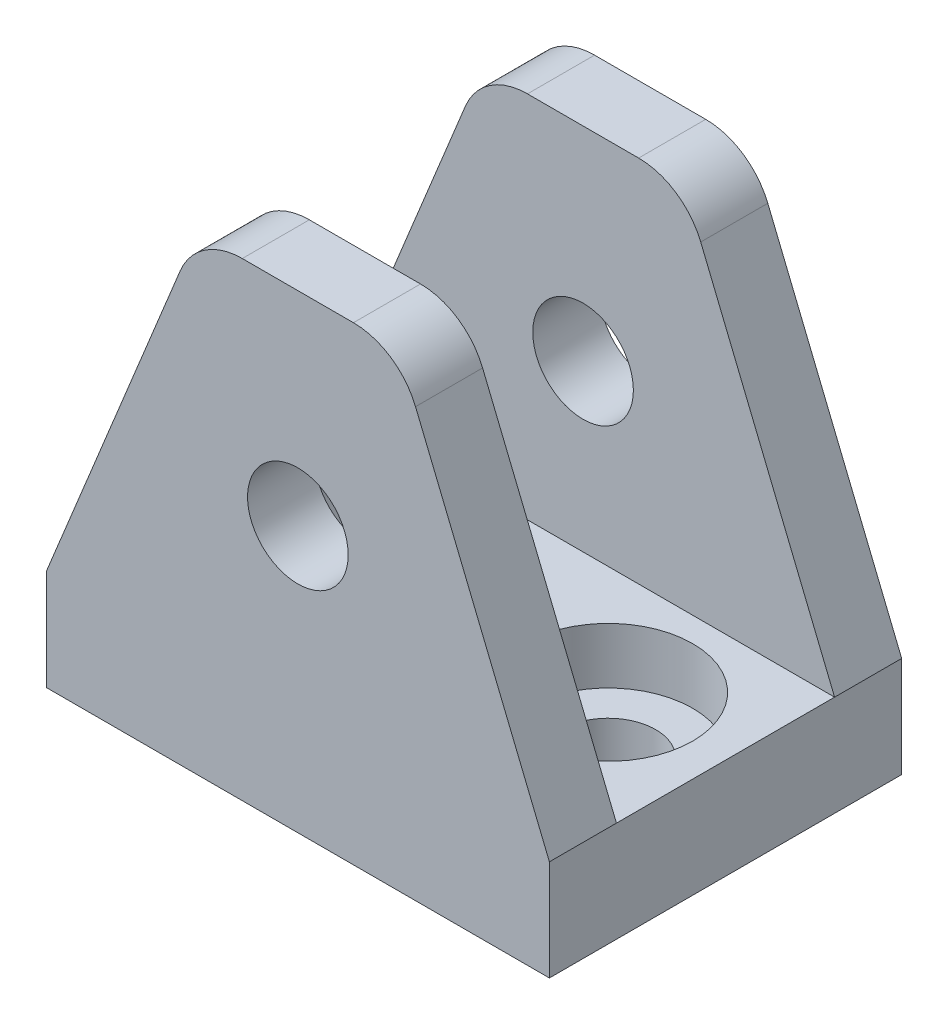
ISO-10303-21;
HEADER;
FILE_DESCRIPTION(('STEP AP214'),'2;1');
FILE_NAME('part.step','',(''),(''),'','','');
FILE_SCHEMA(('AUTOMOTIVE_DESIGN { 1 0 10303 214 1 1 1 1 }'));
ENDSEC;
DATA;
#1=APPLICATION_CONTEXT('core data for automotive mechanical design processes');
#2=APPLICATION_PROTOCOL_DEFINITION('international standard','automotive_design',2000,#1);
#3=PRODUCT_CONTEXT('',#1,'mechanical');
#4=PRODUCT('Part','Part','',(#3));
#5=PRODUCT_RELATED_PRODUCT_CATEGORY('part','',(#4));
#6=PRODUCT_DEFINITION_FORMATION('','',#4);
#7=PRODUCT_DEFINITION_CONTEXT('part definition',#1,'design');
#8=PRODUCT_DEFINITION('design','',#6,#7);
#9=PRODUCT_DEFINITION_SHAPE('','',#8);
#10=(LENGTH_UNIT() NAMED_UNIT(*) SI_UNIT(.MILLI.,.METRE.));
#11=(NAMED_UNIT(*) PLANE_ANGLE_UNIT() SI_UNIT($,.RADIAN.));
#12=(NAMED_UNIT(*) SI_UNIT($,.STERADIAN.) SOLID_ANGLE_UNIT());
#13=UNCERTAINTY_MEASURE_WITH_UNIT(LENGTH_MEASURE(1.E-05),#10,'distance_accuracy_value','');
#14=(GEOMETRIC_REPRESENTATION_CONTEXT(3) GLOBAL_UNCERTAINTY_ASSIGNED_CONTEXT((#13)) GLOBAL_UNIT_ASSIGNED_CONTEXT((#10,
#11,#12)) REPRESENTATION_CONTEXT('',''));
#15=CARTESIAN_POINT('',(0.,0.,0.));
#16=DIRECTION('',(0.,0.,1.));
#17=DIRECTION('',(1.,0.,0.));
#18=AXIS2_PLACEMENT_3D('',#15,#16,#17);
#19=CARTESIAN_POINT('',(0.,44.45,0.));
#20=DIRECTION('',(0.,-1.,0.));
#21=DIRECTION('',(0.,0.,-1.));
#22=AXIS2_PLACEMENT_3D('',#19,#20,#21);
#23=PLANE('',#22);
#24=DIRECTION('',(-1.,0.,0.));
#25=VECTOR('',#24,1.);
#26=CARTESIAN_POINT('',(-23.8125,44.45,-10.3251));
#27=LINE('',#26,#25);
#28=CARTESIAN_POINT('',(5.26191923114274,44.45,-10.3251));
#29=VERTEX_POINT('',#28);
#30=CARTESIAN_POINT('',(-5.26191923114273,44.45,-10.3251));
#31=VERTEX_POINT('',#30);
#32=EDGE_CURVE('E229',#29,#31,#27,.T.);
#33=ORIENTED_EDGE('',*,*,#32,.F.);
#34=DIRECTION('',(0.,0.,-1.));
#35=VECTOR('',#34,1.);
#36=CARTESIAN_POINT('',(5.26191923114274,44.45,0.));
#37=LINE('',#36,#35);
#38=CARTESIAN_POINT('',(5.26191923114274,44.45,-16.6751));
#39=VERTEX_POINT('',#38);
#40=EDGE_CURVE('E222',#29,#39,#37,.T.);
#41=ORIENTED_EDGE('',*,*,#40,.T.);
#42=DIRECTION('',(-1.,0.,0.));
#43=VECTOR('',#42,1.);
#44=CARTESIAN_POINT('',(-23.8125,44.45,-16.6751));
#45=LINE('',#44,#43);
#46=CARTESIAN_POINT('',(-5.26191923114273,44.45,-16.6751));
#47=VERTEX_POINT('',#46);
#48=EDGE_CURVE('E255',#39,#47,#45,.T.);
#49=ORIENTED_EDGE('',*,*,#48,.T.);
#50=DIRECTION('',(0.,0.,-1.));
#51=VECTOR('',#50,1.);
#52=CARTESIAN_POINT('',(-5.26191923114273,44.45,-10.3251));
#53=LINE('',#52,#51);
#54=EDGE_CURVE('E220',#47,#31,#53,.F.);
#55=ORIENTED_EDGE('',*,*,#54,.T.);
#56=EDGE_LOOP('',(#33,#41,#49,#55));
#57=FACE_BOUND('',#56,.T.);
#58=ADVANCED_FACE('F41',(#57),#23,.F.);
#59=CARTESIAN_POINT('',(-23.8125,44.45,-16.6751));
#60=DIRECTION('',(0.,0.,1.));
#61=DIRECTION('',(1.,0.,0.));
#62=AXIS2_PLACEMENT_3D('',#59,#60,#61);
#63=PLANE('',#62);
#64=CARTESIAN_POINT('',(-2.32470293015652E-11,25.1616625766068,-16.6751));
#65=DIRECTION('',(0.,0.,1.));
#66=DIRECTION('',(1.,0.,0.));
#67=AXIS2_PLACEMENT_3D('',#64,#65,#66);
#68=CIRCLE('',#67,4.76249999999999);
#69=CARTESIAN_POINT('',(4.76249999997674,25.1616625766068,-16.6751));
#70=VERTEX_POINT('',#69);
#71=EDGE_CURVE('E45',#70,#70,#68,.T.);
#72=ORIENTED_EDGE('',*,*,#71,.T.);
#73=EDGE_LOOP('',(#72));
#74=FACE_BOUND('',#73,.T.);
#75=ORIENTED_EDGE('',*,*,#48,.F.);
#76=CARTESIAN_POINT('',(5.26191923114274,38.1,-16.6751));
#77=DIRECTION('',(0.,0.,1.));
#78=DIRECTION('',(1.,0.,0.));
#79=AXIS2_PLACEMENT_3D('',#76,#77,#78);
#80=CIRCLE('',#79,6.35);
#81=CARTESIAN_POINT('',(11.1391424030488,40.5043185703252,-16.6751));
#82=VERTEX_POINT('',#81);
#83=EDGE_CURVE('E347',#39,#82,#80,.F.);
#84=ORIENTED_EDGE('',*,*,#83,.T.);
#85=DIRECTION('',(0.378632845720504,-0.925546956205677,0.));
#86=VECTOR('',#85,1.);
#87=CARTESIAN_POINT('',(4.74564159292036,56.1328761061947,-16.6751));
#88=LINE('',#87,#86);
#89=CARTESIAN_POINT('',(23.8125,9.525,-16.6751));
#90=VERTEX_POINT('',#89);
#91=EDGE_CURVE('E231',#82,#90,#88,.T.);
#92=ORIENTED_EDGE('',*,*,#91,.T.);
#93=DIRECTION('',(0.,-1.,0.));
#94=VECTOR('',#93,1.);
#95=CARTESIAN_POINT('',(23.8125,44.45,-16.6751));
#96=LINE('',#95,#94);
#97=CARTESIAN_POINT('',(23.8125,0.,-16.6751));
#98=VERTEX_POINT('',#97);
#99=EDGE_CURVE('E180',#90,#98,#96,.T.);
#100=ORIENTED_EDGE('',*,*,#99,.T.);
#101=DIRECTION('',(-1.,0.,0.));
#102=VECTOR('',#101,1.);
#103=CARTESIAN_POINT('',(-23.8125,0.,-16.6751));
#104=LINE('',#103,#102);
#105=CARTESIAN_POINT('',(-23.8125,0.,-16.6751));
#106=VERTEX_POINT('',#105);
#107=EDGE_CURVE('E263',#98,#106,#104,.T.);
#108=ORIENTED_EDGE('',*,*,#107,.T.);
#109=DIRECTION('',(0.,-1.,0.));
#110=VECTOR('',#109,1.);
#111=CARTESIAN_POINT('',(-23.8125,44.45,-16.6751));
#112=LINE('',#111,#110);
#113=CARTESIAN_POINT('',(-23.8125,9.525,-16.6751));
#114=VERTEX_POINT('',#113);
#115=EDGE_CURVE('E177',#114,#106,#112,.T.);
#116=ORIENTED_EDGE('',*,*,#115,.F.);
#117=DIRECTION('',(-0.378632845720504,-0.925546956205677,0.));
#118=VECTOR('',#117,1.);
#119=CARTESIAN_POINT('',(-11.573296460177,39.4430530973451,-16.6751));
#120=LINE('',#119,#118);
#121=CARTESIAN_POINT('',(-11.1391424030488,40.5043185703252,-16.6751));
#122=VERTEX_POINT('',#121);
#123=EDGE_CURVE('E226',#122,#114,#120,.T.);
#124=ORIENTED_EDGE('',*,*,#123,.F.);
#125=CARTESIAN_POINT('',(-5.26191923114273,38.1,-16.6751));
#126=DIRECTION('',(0.,0.,1.));
#127=DIRECTION('',(1.,0.,0.));
#128=AXIS2_PLACEMENT_3D('',#125,#126,#127);
#129=CIRCLE('',#128,6.35);
#130=EDGE_CURVE('E225',#122,#47,#129,.F.);
#131=ORIENTED_EDGE('',*,*,#130,.T.);
#132=EDGE_LOOP('',(#75,#84,#92,#100,#108,#116,#124,#131));
#133=FACE_BOUND('',#132,.T.);
#134=ADVANCED_FACE('F322',(#74,#133),#63,.F.);
#135=CARTESIAN_POINT('',(-23.8125,44.45,16.6751));
#136=DIRECTION('',(1.,0.,0.));
#137=DIRECTION('',(0.,0.,-1.));
#138=AXIS2_PLACEMENT_3D('',#135,#136,#137);
#139=PLANE('',#138);
#140=DIRECTION('',(0.,0.,-1.));
#141=VECTOR('',#140,1.);
#142=CARTESIAN_POINT('',(-23.8125,9.525,16.6751));
#143=LINE('',#142,#141);
#144=CARTESIAN_POINT('',(-23.8125,9.525,-10.3251));
#145=VERTEX_POINT('',#144);
#146=EDGE_CURVE('E159',#145,#114,#143,.T.);
#147=ORIENTED_EDGE('',*,*,#146,.T.);
#148=ORIENTED_EDGE('',*,*,#115,.T.);
#149=DIRECTION('',(0.,0.,1.));
#150=VECTOR('',#149,1.);
#151=CARTESIAN_POINT('',(-23.8125,0.,16.6751));
#152=LINE('',#151,#150);
#153=CARTESIAN_POINT('',(-23.8125,0.,16.6751));
#154=VERTEX_POINT('',#153);
#155=EDGE_CURVE('E175',#106,#154,#152,.T.);
#156=ORIENTED_EDGE('',*,*,#155,.T.);
#157=DIRECTION('',(0.,-1.,0.));
#158=VECTOR('',#157,1.);
#159=CARTESIAN_POINT('',(-23.8125,44.45,16.6751));
#160=LINE('',#159,#158);
#161=CARTESIAN_POINT('',(-23.8125,9.525,16.6751));
#162=VERTEX_POINT('',#161);
#163=EDGE_CURVE('E165',#162,#154,#160,.T.);
#164=ORIENTED_EDGE('',*,*,#163,.F.);
#165=CARTESIAN_POINT('',(-23.8125,9.525,10.3251));
#166=VERTEX_POINT('',#165);
#167=EDGE_CURVE('E146',#162,#166,#143,.T.);
#168=ORIENTED_EDGE('',*,*,#167,.T.);
#169=DIRECTION('',(0.,0.,1.));
#170=VECTOR('',#169,1.);
#171=CARTESIAN_POINT('',(-23.8125,9.525,10.3251));
#172=LINE('',#171,#170);
#173=EDGE_CURVE('E245',#145,#166,#172,.T.);
#174=ORIENTED_EDGE('',*,*,#173,.F.);
#175=EDGE_LOOP('',(#147,#148,#156,#164,#168,#174));
#176=FACE_BOUND('',#175,.T.);
#177=ADVANCED_FACE('F173',(#176),#139,.F.);
#178=CARTESIAN_POINT('',(-23.8125,44.45,16.6751));
#179=DIRECTION('',(0.,0.,-1.));
#180=DIRECTION('',(-1.,0.,0.));
#181=AXIS2_PLACEMENT_3D('',#178,#179,#180);
#182=PLANE('',#181);
#183=CARTESIAN_POINT('',(-2.32470293015652E-11,25.1616625766068,16.6751));
#184=DIRECTION('',(0.,0.,1.));
#185=DIRECTION('',(1.,0.,0.));
#186=AXIS2_PLACEMENT_3D('',#183,#184,#185);
#187=CIRCLE('',#186,4.76249999999999);
#188=CARTESIAN_POINT('',(4.76249999997674,25.1616625766068,16.6751));
#189=VERTEX_POINT('',#188);
#190=EDGE_CURVE('E315',#189,#189,#187,.T.);
#191=ORIENTED_EDGE('',*,*,#190,.F.);
#192=EDGE_LOOP('',(#191));
#193=FACE_BOUND('',#192,.T.);
#194=DIRECTION('',(-0.378632845720504,0.925546956205677,0.));
#195=VECTOR('',#194,1.);
#196=CARTESIAN_POINT('',(23.7366371681416,9.71044247787611,16.6751));
#197=LINE('',#196,#195);
#198=CARTESIAN_POINT('',(23.8125,9.525,16.6751));
#199=VERTEX_POINT('',#198);
#200=CARTESIAN_POINT('',(11.1391424030488,40.5043185703252,16.6751));
#201=VERTEX_POINT('',#200);
#202=EDGE_CURVE('E197',#199,#201,#197,.T.);
#203=ORIENTED_EDGE('',*,*,#202,.T.);
#204=CARTESIAN_POINT('',(5.26191923114274,38.1,16.6751));
#205=DIRECTION('',(0.,0.,-1.));
#206=DIRECTION('',(-1.,0.,0.));
#207=AXIS2_PLACEMENT_3D('',#204,#205,#206);
#208=CIRCLE('',#207,6.35);
#209=CARTESIAN_POINT('',(5.26191923114274,44.45,16.6751));
#210=VERTEX_POINT('',#209);
#211=EDGE_CURVE('E216',#201,#210,#208,.F.);
#212=ORIENTED_EDGE('',*,*,#211,.T.);
#213=DIRECTION('',(1.,0.,0.));
#214=VECTOR('',#213,1.);
#215=CARTESIAN_POINT('',(-23.8125,44.45,16.6751));
#216=LINE('',#215,#214);
#217=CARTESIAN_POINT('',(-5.26191923114273,44.45,16.6751));
#218=VERTEX_POINT('',#217);
#219=EDGE_CURVE('E182',#218,#210,#216,.T.);
#220=ORIENTED_EDGE('',*,*,#219,.F.);
#221=CARTESIAN_POINT('',(-5.26191923114273,38.1,16.6751));
#222=DIRECTION('',(0.,0.,-1.));
#223=DIRECTION('',(-1.,0.,0.));
#224=AXIS2_PLACEMENT_3D('',#221,#222,#223);
#225=CIRCLE('',#224,6.35);
#226=CARTESIAN_POINT('',(-11.1391424030488,40.5043185703252,16.6751));
#227=VERTEX_POINT('',#226);
#228=EDGE_CURVE('E169',#218,#227,#225,.F.);
#229=ORIENTED_EDGE('',*,*,#228,.T.);
#230=DIRECTION('',(0.378632845720504,0.925546956205677,0.));
#231=VECTOR('',#230,1.);
#232=CARTESIAN_POINT('',(-23.7366371681416,9.71044247787611,16.6751));
#233=LINE('',#232,#231);
#234=EDGE_CURVE('E150',#162,#227,#233,.T.);
#235=ORIENTED_EDGE('',*,*,#234,.F.);
#236=ORIENTED_EDGE('',*,*,#163,.T.);
#237=DIRECTION('',(1.,0.,0.));
#238=VECTOR('',#237,1.);
#239=CARTESIAN_POINT('',(-23.8125,0.,16.6751));
#240=LINE('',#239,#238);
#241=CARTESIAN_POINT('',(23.8125,0.,16.6751));
#242=VERTEX_POINT('',#241);
#243=EDGE_CURVE('E258',#154,#242,#240,.T.);
#244=ORIENTED_EDGE('',*,*,#243,.T.);
#245=DIRECTION('',(0.,-1.,0.));
#246=VECTOR('',#245,1.);
#247=CARTESIAN_POINT('',(23.8125,44.45,16.6751));
#248=LINE('',#247,#246);
#249=EDGE_CURVE('E178',#199,#242,#248,.T.);
#250=ORIENTED_EDGE('',*,*,#249,.F.);
#251=EDGE_LOOP('',(#203,#212,#220,#229,#235,#236,#244,#250));
#252=FACE_BOUND('',#251,.T.);
#253=ADVANCED_FACE('F163',(#193,#252),#182,.F.);
#254=ORIENTED_EDGE('',*,*,#219,.T.);
#255=DIRECTION('',(0.,0.,-1.));
#256=VECTOR('',#255,1.);
#257=CARTESIAN_POINT('',(5.26191923114274,44.45,0.));
#258=LINE('',#257,#256);
#259=CARTESIAN_POINT('',(5.26191923114274,44.45,10.3251));
#260=VERTEX_POINT('',#259);
#261=EDGE_CURVE('E206',#210,#260,#258,.T.);
#262=ORIENTED_EDGE('',*,*,#261,.T.);
#263=DIRECTION('',(1.,0.,0.));
#264=VECTOR('',#263,1.);
#265=CARTESIAN_POINT('',(-23.8125,44.45,10.3251));
#266=LINE('',#265,#264);
#267=CARTESIAN_POINT('',(-5.26191923114273,44.45,10.3251));
#268=VERTEX_POINT('',#267);
#269=EDGE_CURVE('E238',#268,#260,#266,.T.);
#270=ORIENTED_EDGE('',*,*,#269,.F.);
#271=DIRECTION('',(0.,0.,-1.));
#272=VECTOR('',#271,1.);
#273=CARTESIAN_POINT('',(-5.26191923114273,44.45,16.6751));
#274=LINE('',#273,#272);
#275=EDGE_CURVE('E204',#268,#218,#274,.F.);
#276=ORIENTED_EDGE('',*,*,#275,.T.);
#277=EDGE_LOOP('',(#254,#262,#270,#276));
#278=FACE_BOUND('',#277,.T.);
#279=ADVANCED_FACE('F335',(#278),#23,.F.);
#280=CARTESIAN_POINT('',(-23.8125,-51.9092610719899,-10.3251));
#281=DIRECTION('',(0.,0.,-1.));
#282=DIRECTION('',(-1.,0.,0.));
#283=AXIS2_PLACEMENT_3D('',#280,#281,#282);
#284=PLANE('',#283);
#285=CARTESIAN_POINT('',(-2.32470293015652E-11,25.1616625766068,-10.3251));
#286=DIRECTION('',(0.,0.,-1.));
#287=DIRECTION('',(-1.,0.,0.));
#288=AXIS2_PLACEMENT_3D('',#285,#286,#287);
#289=CIRCLE('',#288,4.76249999999999);
#290=CARTESIAN_POINT('',(-4.76250000002324,25.1616625766068,-10.3251));
#291=VERTEX_POINT('',#290);
#292=EDGE_CURVE('E309',#291,#291,#289,.T.);
#293=ORIENTED_EDGE('',*,*,#292,.T.);
#294=EDGE_LOOP('',(#293));
#295=FACE_BOUND('',#294,.T.);
#296=DIRECTION('',(-0.378632845720504,0.925546956205677,0.));
#297=VECTOR('',#296,1.);
#298=CARTESIAN_POINT('',(38.5140198092991,-26.4120484227311,-10.3251));
#299=LINE('',#298,#297);
#300=CARTESIAN_POINT('',(23.8125,9.525,-10.3251));
#301=VERTEX_POINT('',#300);
#302=CARTESIAN_POINT('',(11.1391424030488,40.5043185703252,-10.3251));
#303=VERTEX_POINT('',#302);
#304=EDGE_CURVE('E158',#301,#303,#299,.T.);
#305=ORIENTED_EDGE('',*,*,#304,.T.);
#306=CARTESIAN_POINT('',(5.26191923114274,38.1,-10.3251));
#307=DIRECTION('',(0.,0.,-1.));
#308=DIRECTION('',(-1.,0.,0.));
#309=AXIS2_PLACEMENT_3D('',#306,#307,#308);
#310=CIRCLE('',#309,6.35);
#311=EDGE_CURVE('E50',#303,#29,#310,.F.);
#312=ORIENTED_EDGE('',*,*,#311,.T.);
#313=ORIENTED_EDGE('',*,*,#32,.T.);
#314=CARTESIAN_POINT('',(-5.26191923114273,38.1,-10.3251));
#315=DIRECTION('',(0.,0.,-1.));
#316=DIRECTION('',(-1.,0.,0.));
#317=AXIS2_PLACEMENT_3D('',#314,#315,#316);
#318=CIRCLE('',#317,6.35);
#319=CARTESIAN_POINT('',(-11.1391424030488,40.5043185703252,-10.3251));
#320=VERTEX_POINT('',#319);
#321=EDGE_CURVE('E57',#31,#320,#318,.F.);
#322=ORIENTED_EDGE('',*,*,#321,.T.);
#323=DIRECTION('',(0.378632845720504,0.925546956205677,0.));
#324=VECTOR('',#323,1.);
#325=CARTESIAN_POINT('',(-45.3416746765557,-43.1018714315807,-10.3251));
#326=LINE('',#325,#324);
#327=EDGE_CURVE('E230',#145,#320,#326,.T.);
#328=ORIENTED_EDGE('',*,*,#327,.F.);
#329=DIRECTION('',(-1.,0.,0.));
#330=VECTOR('',#329,1.);
#331=CARTESIAN_POINT('',(-23.8125,9.525,-10.3251));
#332=LINE('',#331,#330);
#333=EDGE_CURVE('E241',#301,#145,#332,.T.);
#334=ORIENTED_EDGE('',*,*,#333,.F.);
#335=EDGE_LOOP('',(#305,#312,#313,#322,#328,#334));
#336=FACE_BOUND('',#335,.T.);
#337=ADVANCED_FACE('F332',(#295,#336),#284,.F.);
#338=CARTESIAN_POINT('',(-23.8125,-51.9092610719899,10.3251));
#339=DIRECTION('',(0.,0.,1.));
#340=DIRECTION('',(1.,0.,0.));
#341=AXIS2_PLACEMENT_3D('',#338,#339,#340);
#342=PLANE('',#341);
#343=CARTESIAN_POINT('',(-2.32470293015652E-11,25.1616625766068,10.3251));
#344=DIRECTION('',(0.,0.,1.));
#345=DIRECTION('',(1.,0.,0.));
#346=AXIS2_PLACEMENT_3D('',#343,#344,#345);
#347=CIRCLE('',#346,4.76249999999999);
#348=CARTESIAN_POINT('',(4.76249999997674,25.1616625766068,10.3251));
#349=VERTEX_POINT('',#348);
#350=EDGE_CURVE('E312',#349,#349,#347,.T.);
#351=ORIENTED_EDGE('',*,*,#350,.T.);
#352=EDGE_LOOP('',(#351));
#353=FACE_BOUND('',#352,.T.);
#354=ORIENTED_EDGE('',*,*,#269,.T.);
#355=CARTESIAN_POINT('',(5.26191923114274,38.1,10.3251));
#356=DIRECTION('',(0.,0.,1.));
#357=DIRECTION('',(1.,0.,0.));
#358=AXIS2_PLACEMENT_3D('',#355,#356,#357);
#359=CIRCLE('',#358,6.35);
#360=CARTESIAN_POINT('',(11.1391424030488,40.5043185703252,10.3251));
#361=VERTEX_POINT('',#360);
#362=EDGE_CURVE('E211',#260,#361,#359,.F.);
#363=ORIENTED_EDGE('',*,*,#362,.T.);
#364=DIRECTION('',(0.378632845720504,-0.925546956205677,0.));
#365=VECTOR('',#364,1.);
#366=CARTESIAN_POINT('',(38.5140198092991,-26.4120484227311,10.3251));
#367=LINE('',#366,#365);
#368=CARTESIAN_POINT('',(23.8125,9.525,10.3251));
#369=VERTEX_POINT('',#368);
#370=EDGE_CURVE('E193',#361,#369,#367,.T.);
#371=ORIENTED_EDGE('',*,*,#370,.T.);
#372=DIRECTION('',(1.,0.,0.));
#373=VECTOR('',#372,1.);
#374=CARTESIAN_POINT('',(-23.8125,9.525,10.3251));
#375=LINE('',#374,#373);
#376=EDGE_CURVE('E250',#166,#369,#375,.T.);
#377=ORIENTED_EDGE('',*,*,#376,.F.);
#378=DIRECTION('',(-0.378632845720504,-0.925546956205677,0.));
#379=VECTOR('',#378,1.);
#380=CARTESIAN_POINT('',(-45.3416746765557,-43.1018714315807,10.3251));
#381=LINE('',#380,#379);
#382=CARTESIAN_POINT('',(-11.1391424030488,40.5043185703252,10.3251));
#383=VERTEX_POINT('',#382);
#384=EDGE_CURVE('E153',#383,#166,#381,.T.);
#385=ORIENTED_EDGE('',*,*,#384,.F.);
#386=CARTESIAN_POINT('',(-5.26191923114273,38.1,10.3251));
#387=DIRECTION('',(0.,0.,1.));
#388=DIRECTION('',(1.,0.,0.));
#389=AXIS2_PLACEMENT_3D('',#386,#387,#388);
#390=CIRCLE('',#389,6.35);
#391=EDGE_CURVE('E209',#383,#268,#390,.F.);
#392=ORIENTED_EDGE('',*,*,#391,.T.);
#393=EDGE_LOOP('',(#354,#363,#371,#377,#385,#392));
#394=FACE_BOUND('',#393,.T.);
#395=ADVANCED_FACE('F334',(#353,#394),#342,.F.);
#396=CARTESIAN_POINT('',(23.8125,44.45,16.6751));
#397=DIRECTION('',(-1.,0.,0.));
#398=DIRECTION('',(0.,0.,1.));
#399=AXIS2_PLACEMENT_3D('',#396,#397,#398);
#400=PLANE('',#399);
#401=ORIENTED_EDGE('',*,*,#99,.F.);
#402=DIRECTION('',(0.,0.,-1.));
#403=VECTOR('',#402,1.);
#404=CARTESIAN_POINT('',(23.8125,9.525,16.6751));
#405=LINE('',#404,#403);
#406=EDGE_CURVE('E280',#301,#90,#405,.T.);
#407=ORIENTED_EDGE('',*,*,#406,.F.);
#408=DIRECTION('',(0.,0.,-1.));
#409=VECTOR('',#408,1.);
#410=CARTESIAN_POINT('',(23.8125,9.525,10.3251));
#411=LINE('',#410,#409);
#412=EDGE_CURVE('E246',#369,#301,#411,.T.);
#413=ORIENTED_EDGE('',*,*,#412,.F.);
#414=EDGE_CURVE('E170',#199,#369,#405,.T.);
#415=ORIENTED_EDGE('',*,*,#414,.F.);
#416=ORIENTED_EDGE('',*,*,#249,.T.);
#417=DIRECTION('',(0.,0.,-1.));
#418=VECTOR('',#417,1.);
#419=CARTESIAN_POINT('',(23.8125,0.,16.6751));
#420=LINE('',#419,#418);
#421=EDGE_CURVE('E249',#242,#98,#420,.T.);
#422=ORIENTED_EDGE('',*,*,#421,.T.);
#423=EDGE_LOOP('',(#401,#407,#413,#415,#416,#422));
#424=FACE_BOUND('',#423,.T.);
#425=ADVANCED_FACE('F273',(#424),#400,.F.);
#426=CARTESIAN_POINT('',(0.,0.,0.));
#427=DIRECTION('',(0.,-1.,0.));
#428=DIRECTION('',(0.,0.,-1.));
#429=AXIS2_PLACEMENT_3D('',#426,#427,#428);
#430=PLANE('',#429);
#431=CARTESIAN_POINT('',(-12.7,0.,0.));
#432=DIRECTION('',(0.,-1.,0.));
#433=DIRECTION('',(0.,0.,-1.));
#434=AXIS2_PLACEMENT_3D('',#431,#432,#433);
#435=CIRCLE('',#434,4.5);
#436=CARTESIAN_POINT('',(-12.7,0.,-4.5));
#437=VERTEX_POINT('',#436);
#438=EDGE_CURVE('E199',#437,#437,#435,.T.);
#439=ORIENTED_EDGE('',*,*,#438,.F.);
#440=EDGE_LOOP('',(#439));
#441=FACE_BOUND('',#440,.T.);
#442=CARTESIAN_POINT('',(12.7,0.,0.));
#443=DIRECTION('',(0.,-1.,0.));
#444=DIRECTION('',(0.,0.,-1.));
#445=AXIS2_PLACEMENT_3D('',#442,#443,#444);
#446=CIRCLE('',#445,4.5);
#447=CARTESIAN_POINT('',(12.7,0.,-4.5));
#448=VERTEX_POINT('',#447);
#449=EDGE_CURVE('E194',#448,#448,#446,.T.);
#450=ORIENTED_EDGE('',*,*,#449,.F.);
#451=EDGE_LOOP('',(#450));
#452=FACE_BOUND('',#451,.T.);
#453=ORIENTED_EDGE('',*,*,#421,.F.);
#454=ORIENTED_EDGE('',*,*,#243,.F.);
#455=ORIENTED_EDGE('',*,*,#155,.F.);
#456=ORIENTED_EDGE('',*,*,#107,.F.);
#457=EDGE_LOOP('',(#453,#454,#455,#456));
#458=FACE_BOUND('',#457,.T.);
#459=ADVANCED_FACE('F270',(#441,#452,#458),#430,.T.);
#460=CARTESIAN_POINT('',(0.,9.525,0.));
#461=DIRECTION('',(0.,-1.,0.));
#462=DIRECTION('',(0.,0.,-1.));
#463=AXIS2_PLACEMENT_3D('',#460,#461,#462);
#464=PLANE('',#463);
#465=CARTESIAN_POINT('',(-12.7,9.525,0.));
#466=DIRECTION('',(0.,1.,0.));
#467=DIRECTION('',(0.,0.,1.));
#468=AXIS2_PLACEMENT_3D('',#465,#466,#467);
#469=CIRCLE('',#468,8.);
#470=CARTESIAN_POINT('',(-12.7,9.525,8.));
#471=VERTEX_POINT('',#470);
#472=EDGE_CURVE('E306',#471,#471,#469,.T.);
#473=ORIENTED_EDGE('',*,*,#472,.F.);
#474=EDGE_LOOP('',(#473));
#475=FACE_BOUND('',#474,.T.);
#476=CARTESIAN_POINT('',(12.7,9.525,0.));
#477=DIRECTION('',(0.,1.,0.));
#478=DIRECTION('',(0.,0.,1.));
#479=AXIS2_PLACEMENT_3D('',#476,#477,#478);
#480=CIRCLE('',#479,8.);
#481=CARTESIAN_POINT('',(12.7,9.525,8.));
#482=VERTEX_POINT('',#481);
#483=EDGE_CURVE('E202',#482,#482,#480,.T.);
#484=ORIENTED_EDGE('',*,*,#483,.F.);
#485=EDGE_LOOP('',(#484));
#486=FACE_BOUND('',#485,.T.);
#487=ORIENTED_EDGE('',*,*,#412,.T.);
#488=ORIENTED_EDGE('',*,*,#333,.T.);
#489=ORIENTED_EDGE('',*,*,#173,.T.);
#490=ORIENTED_EDGE('',*,*,#376,.T.);
#491=EDGE_LOOP('',(#487,#488,#489,#490));
#492=FACE_BOUND('',#491,.T.);
#493=ADVANCED_FACE('F369',(#475,#486,#492),#464,.F.);
#494=CARTESIAN_POINT('',(23.7366371681416,9.71044247787611,16.6751));
#495=DIRECTION('',(-0.925546956205677,-0.378632845720504,0.));
#496=DIRECTION('',(0.378632845720504,-0.925546956205677,0.));
#497=AXIS2_PLACEMENT_3D('',#494,#495,#496);
#498=PLANE('',#497);
#499=ORIENTED_EDGE('',*,*,#370,.F.);
#500=DIRECTION('',(0.,0.,-1.));
#501=VECTOR('',#500,1.);
#502=CARTESIAN_POINT('',(11.1391424030488,40.5043185703252,16.6751));
#503=LINE('',#502,#501);
#504=EDGE_CURVE('E213',#361,#201,#503,.F.);
#505=ORIENTED_EDGE('',*,*,#504,.T.);
#506=ORIENTED_EDGE('',*,*,#202,.F.);
#507=ORIENTED_EDGE('',*,*,#414,.T.);
#508=EDGE_LOOP('',(#499,#505,#506,#507));
#509=FACE_BOUND('',#508,.T.);
#510=ADVANCED_FACE('F360',(#509),#498,.F.);
#511=CARTESIAN_POINT('',(-23.7366371681416,9.71044247787611,16.6751));
#512=DIRECTION('',(-0.925546956205677,0.378632845720504,0.));
#513=DIRECTION('',(-0.378632845720504,-0.925546956205677,0.));
#514=AXIS2_PLACEMENT_3D('',#511,#512,#513);
#515=PLANE('',#514);
#516=ORIENTED_EDGE('',*,*,#234,.T.);
#517=DIRECTION('',(0.,0.,-1.));
#518=VECTOR('',#517,1.);
#519=CARTESIAN_POINT('',(-11.1391424030488,40.5043185703252,10.3251));
#520=LINE('',#519,#518);
#521=EDGE_CURVE('E218',#227,#383,#520,.T.);
#522=ORIENTED_EDGE('',*,*,#521,.T.);
#523=ORIENTED_EDGE('',*,*,#384,.T.);
#524=ORIENTED_EDGE('',*,*,#167,.F.);
#525=EDGE_LOOP('',(#516,#522,#523,#524));
#526=FACE_BOUND('',#525,.T.);
#527=ADVANCED_FACE('F148',(#526),#515,.T.);
#528=ORIENTED_EDGE('',*,*,#91,.F.);
#529=DIRECTION('',(0.,0.,-1.));
#530=VECTOR('',#529,1.);
#531=CARTESIAN_POINT('',(11.1391424030488,40.5043185703252,16.6751));
#532=LINE('',#531,#530);
#533=EDGE_CURVE('E65',#82,#303,#532,.F.);
#534=ORIENTED_EDGE('',*,*,#533,.T.);
#535=ORIENTED_EDGE('',*,*,#304,.F.);
#536=ORIENTED_EDGE('',*,*,#406,.T.);
#537=EDGE_LOOP('',(#528,#534,#535,#536));
#538=FACE_BOUND('',#537,.T.);
#539=ADVANCED_FACE('F357',(#538),#498,.F.);
#540=ORIENTED_EDGE('',*,*,#327,.T.);
#541=DIRECTION('',(0.,0.,-1.));
#542=VECTOR('',#541,1.);
#543=CARTESIAN_POINT('',(-11.1391424030488,40.5043185703252,-16.6751));
#544=LINE('',#543,#542);
#545=EDGE_CURVE('E12',#320,#122,#544,.T.);
#546=ORIENTED_EDGE('',*,*,#545,.T.);
#547=ORIENTED_EDGE('',*,*,#123,.T.);
#548=ORIENTED_EDGE('',*,*,#146,.F.);
#549=EDGE_LOOP('',(#540,#546,#547,#548));
#550=FACE_BOUND('',#549,.T.);
#551=ADVANCED_FACE('F356',(#550),#515,.T.);
#552=CARTESIAN_POINT('',(12.7,9.525,0.));
#553=DIRECTION('',(0.,1.,0.));
#554=DIRECTION('',(0.,0.,1.));
#555=AXIS2_PLACEMENT_3D('',#552,#553,#554);
#556=CYLINDRICAL_SURFACE('',#555,4.5);
#557=ORIENTED_EDGE('',*,*,#449,.T.);
#558=EDGE_LOOP('',(#557));
#559=FACE_BOUND('',#558,.T.);
#560=CARTESIAN_POINT('',(12.7,4.225,0.));
#561=DIRECTION('',(0.,1.,0.));
#562=DIRECTION('',(0.,0.,1.));
#563=AXIS2_PLACEMENT_3D('',#560,#561,#562);
#564=CIRCLE('',#563,4.5);
#565=CARTESIAN_POINT('',(12.7,4.225,4.5));
#566=VERTEX_POINT('',#565);
#567=EDGE_CURVE('E198',#566,#566,#564,.T.);
#568=ORIENTED_EDGE('',*,*,#567,.T.);
#569=EDGE_LOOP('',(#568));
#570=FACE_BOUND('',#569,.T.);
#571=ADVANCED_FACE('F365',(#559,#570),#556,.F.);
#572=CARTESIAN_POINT('',(17.2,4.225,0.));
#573=DIRECTION('',(0.,-1.,0.));
#574=DIRECTION('',(0.,0.,-1.));
#575=AXIS2_PLACEMENT_3D('',#572,#573,#574);
#576=PLANE('',#575);
#577=ORIENTED_EDGE('',*,*,#567,.F.);
#578=EDGE_LOOP('',(#577));
#579=FACE_BOUND('',#578,.T.);
#580=CARTESIAN_POINT('',(12.7,4.225,0.));
#581=DIRECTION('',(0.,1.,0.));
#582=DIRECTION('',(0.,0.,1.));
#583=AXIS2_PLACEMENT_3D('',#580,#581,#582);
#584=CIRCLE('',#583,8.);
#585=CARTESIAN_POINT('',(12.7,4.225,8.));
#586=VERTEX_POINT('',#585);
#587=EDGE_CURVE('E296',#586,#586,#584,.T.);
#588=ORIENTED_EDGE('',*,*,#587,.T.);
#589=EDGE_LOOP('',(#588));
#590=FACE_BOUND('',#589,.T.);
#591=ADVANCED_FACE('F431',(#579,#590),#576,.F.);
#592=CARTESIAN_POINT('',(12.7,9.525,0.));
#593=DIRECTION('',(0.,1.,0.));
#594=DIRECTION('',(0.,0.,1.));
#595=AXIS2_PLACEMENT_3D('',#592,#593,#594);
#596=CYLINDRICAL_SURFACE('',#595,8.);
#597=ORIENTED_EDGE('',*,*,#587,.F.);
#598=EDGE_LOOP('',(#597));
#599=FACE_BOUND('',#598,.T.);
#600=ORIENTED_EDGE('',*,*,#483,.T.);
#601=EDGE_LOOP('',(#600));
#602=FACE_BOUND('',#601,.T.);
#603=ADVANCED_FACE('F427',(#599,#602),#596,.F.);
#604=CARTESIAN_POINT('',(-12.7,9.525,0.));
#605=DIRECTION('',(0.,1.,0.));
#606=DIRECTION('',(0.,0.,1.));
#607=AXIS2_PLACEMENT_3D('',#604,#605,#606);
#608=CYLINDRICAL_SURFACE('',#607,4.5);
#609=ORIENTED_EDGE('',*,*,#438,.T.);
#610=EDGE_LOOP('',(#609));
#611=FACE_BOUND('',#610,.T.);
#612=CARTESIAN_POINT('',(-12.7,4.225,0.));
#613=DIRECTION('',(0.,1.,0.));
#614=DIRECTION('',(0.,0.,1.));
#615=AXIS2_PLACEMENT_3D('',#612,#613,#614);
#616=CIRCLE('',#615,4.5);
#617=CARTESIAN_POINT('',(-12.7,4.225,4.5));
#618=VERTEX_POINT('',#617);
#619=EDGE_CURVE('E203',#618,#618,#616,.T.);
#620=ORIENTED_EDGE('',*,*,#619,.T.);
#621=EDGE_LOOP('',(#620));
#622=FACE_BOUND('',#621,.T.);
#623=ADVANCED_FACE('F423',(#611,#622),#608,.F.);
#624=CARTESIAN_POINT('',(-8.2,4.225,0.));
#625=DIRECTION('',(0.,-1.,0.));
#626=DIRECTION('',(0.,0.,-1.));
#627=AXIS2_PLACEMENT_3D('',#624,#625,#626);
#628=PLANE('',#627);
#629=ORIENTED_EDGE('',*,*,#619,.F.);
#630=EDGE_LOOP('',(#629));
#631=FACE_BOUND('',#630,.T.);
#632=CARTESIAN_POINT('',(-12.7,4.225,0.));
#633=DIRECTION('',(0.,1.,0.));
#634=DIRECTION('',(0.,0.,1.));
#635=AXIS2_PLACEMENT_3D('',#632,#633,#634);
#636=CIRCLE('',#635,8.);
#637=CARTESIAN_POINT('',(-12.7,4.225,8.));
#638=VERTEX_POINT('',#637);
#639=EDGE_CURVE('E303',#638,#638,#636,.T.);
#640=ORIENTED_EDGE('',*,*,#639,.T.);
#641=EDGE_LOOP('',(#640));
#642=FACE_BOUND('',#641,.T.);
#643=ADVANCED_FACE('F419',(#631,#642),#628,.F.);
#644=CARTESIAN_POINT('',(-12.7,9.525,0.));
#645=DIRECTION('',(0.,1.,0.));
#646=DIRECTION('',(0.,0.,1.));
#647=AXIS2_PLACEMENT_3D('',#644,#645,#646);
#648=CYLINDRICAL_SURFACE('',#647,8.);
#649=ORIENTED_EDGE('',*,*,#639,.F.);
#650=EDGE_LOOP('',(#649));
#651=FACE_BOUND('',#650,.T.);
#652=ORIENTED_EDGE('',*,*,#472,.T.);
#653=EDGE_LOOP('',(#652));
#654=FACE_BOUND('',#653,.T.);
#655=ADVANCED_FACE('F416',(#651,#654),#648,.F.);
#656=CARTESIAN_POINT('',(5.26191923114274,38.1,0.));
#657=DIRECTION('',(0.,0.,-1.));
#658=DIRECTION('',(-1.,0.,0.));
#659=AXIS2_PLACEMENT_3D('',#656,#657,#658);
#660=CYLINDRICAL_SURFACE('',#659,6.35);
#661=ORIENTED_EDGE('',*,*,#211,.F.);
#662=ORIENTED_EDGE('',*,*,#504,.F.);
#663=ORIENTED_EDGE('',*,*,#362,.F.);
#664=ORIENTED_EDGE('',*,*,#261,.F.);
#665=EDGE_LOOP('',(#661,#662,#663,#664));
#666=FACE_BOUND('',#665,.T.);
#667=ADVANCED_FACE('F390',(#666),#660,.T.);
#668=CARTESIAN_POINT('',(-5.26191923114273,38.1,16.6751));
#669=DIRECTION('',(0.,0.,1.));
#670=DIRECTION('',(1.,0.,0.));
#671=AXIS2_PLACEMENT_3D('',#668,#669,#670);
#672=CYLINDRICAL_SURFACE('',#671,6.35);
#673=ORIENTED_EDGE('',*,*,#228,.F.);
#674=ORIENTED_EDGE('',*,*,#275,.F.);
#675=ORIENTED_EDGE('',*,*,#391,.F.);
#676=ORIENTED_EDGE('',*,*,#521,.F.);
#677=EDGE_LOOP('',(#673,#674,#675,#676));
#678=FACE_BOUND('',#677,.T.);
#679=ADVANCED_FACE('F394',(#678),#672,.T.);
#680=CARTESIAN_POINT('',(5.26191923114274,38.1,0.));
#681=DIRECTION('',(0.,0.,-1.));
#682=DIRECTION('',(-1.,0.,0.));
#683=AXIS2_PLACEMENT_3D('',#680,#681,#682);
#684=CYLINDRICAL_SURFACE('',#683,6.35);
#685=ORIENTED_EDGE('',*,*,#311,.F.);
#686=ORIENTED_EDGE('',*,*,#533,.F.);
#687=ORIENTED_EDGE('',*,*,#83,.F.);
#688=ORIENTED_EDGE('',*,*,#40,.F.);
#689=EDGE_LOOP('',(#685,#686,#687,#688));
#690=FACE_BOUND('',#689,.T.);
#691=ADVANCED_FACE('F342',(#690),#684,.T.);
#692=CARTESIAN_POINT('',(-5.26191923114273,38.1,16.6751));
#693=DIRECTION('',(0.,0.,1.));
#694=DIRECTION('',(1.,0.,0.));
#695=AXIS2_PLACEMENT_3D('',#692,#693,#694);
#696=CYLINDRICAL_SURFACE('',#695,6.35);
#697=ORIENTED_EDGE('',*,*,#321,.F.);
#698=ORIENTED_EDGE('',*,*,#54,.F.);
#699=ORIENTED_EDGE('',*,*,#130,.F.);
#700=ORIENTED_EDGE('',*,*,#545,.F.);
#701=EDGE_LOOP('',(#697,#698,#699,#700));
#702=FACE_BOUND('',#701,.T.);
#703=ADVANCED_FACE('F43',(#702),#696,.T.);
#704=CARTESIAN_POINT('',(-2.32470293015652E-11,25.1616625766068,16.6751));
#705=DIRECTION('',(0.,0.,1.));
#706=DIRECTION('',(1.,0.,0.));
#707=AXIS2_PLACEMENT_3D('',#704,#705,#706);
#708=CYLINDRICAL_SURFACE('',#707,4.76249999999999);
#709=ORIENTED_EDGE('',*,*,#71,.F.);
#710=EDGE_LOOP('',(#709));
#711=FACE_BOUND('',#710,.T.);
#712=ORIENTED_EDGE('',*,*,#292,.F.);
#713=EDGE_LOOP('',(#712));
#714=FACE_BOUND('',#713,.T.);
#715=ADVANCED_FACE('F325',(#711,#714),#708,.F.);
#716=ORIENTED_EDGE('',*,*,#190,.T.);
#717=EDGE_LOOP('',(#716));
#718=FACE_BOUND('',#717,.T.);
#719=ORIENTED_EDGE('',*,*,#350,.F.);
#720=EDGE_LOOP('',(#719));
#721=FACE_BOUND('',#720,.T.);
#722=ADVANCED_FACE('F328',(#718,#721),#708,.F.);
#723=CLOSED_SHELL('',(#58,#134,#177,#253,#279,#337,#395,#425,#459,#493,#510,#527,#539,#551,#571,
#591,#603,#623,#643,#655,#667,#679,#691,#703,#715,#722));
#724=MANIFOLD_SOLID_BREP('B2',#723);
#725=ADVANCED_BREP_SHAPE_REPRESENTATION('',(#18,#724),#14);
#726=SHAPE_DEFINITION_REPRESENTATION(#9,#725);
ENDSEC;
END-ISO-10303-21;
